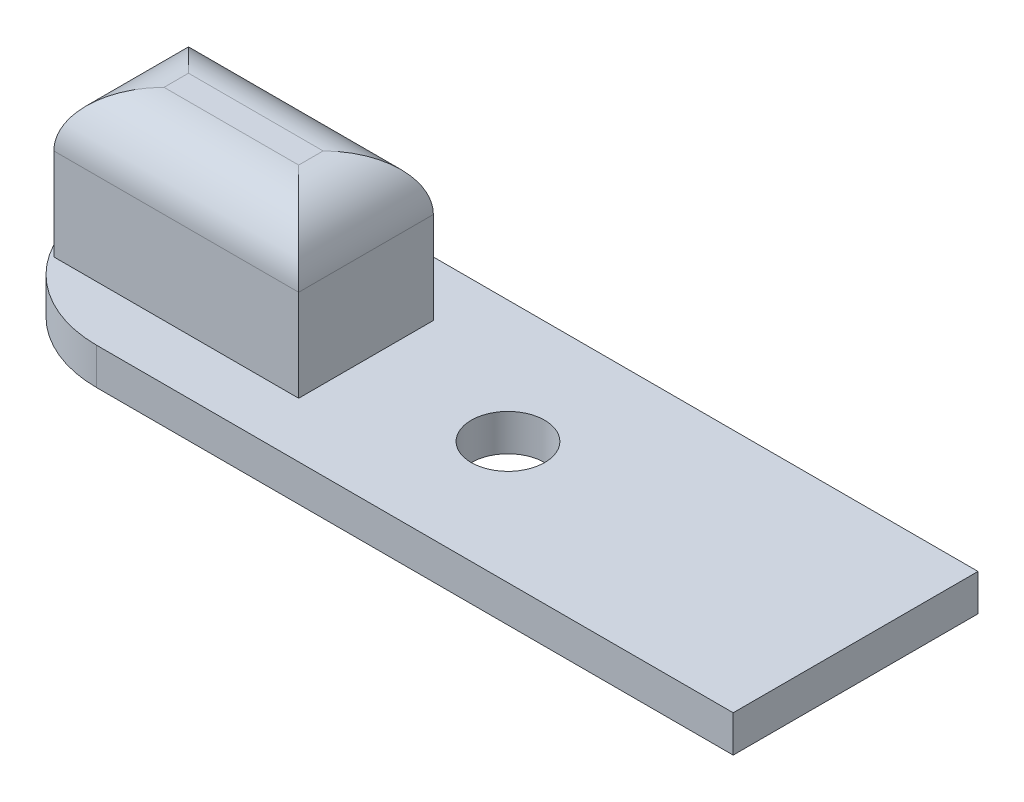
ISO-10303-21;
HEADER;
FILE_DESCRIPTION(('STEP AP214'),'2;1');
FILE_NAME('part.step','',(''),(''),'','','');
FILE_SCHEMA(('AUTOMOTIVE_DESIGN { 1 0 10303 214 1 1 1 1 }'));
ENDSEC;
DATA;
#1=APPLICATION_CONTEXT('core data for automotive mechanical design processes');
#2=APPLICATION_PROTOCOL_DEFINITION('international standard','automotive_design',2000,#1);
#3=PRODUCT_CONTEXT('',#1,'mechanical');
#4=PRODUCT('Part','Part','',(#3));
#5=PRODUCT_RELATED_PRODUCT_CATEGORY('part','',(#4));
#6=PRODUCT_DEFINITION_FORMATION('','',#4);
#7=PRODUCT_DEFINITION_CONTEXT('part definition',#1,'design');
#8=PRODUCT_DEFINITION('design','',#6,#7);
#9=PRODUCT_DEFINITION_SHAPE('','',#8);
#10=(LENGTH_UNIT() NAMED_UNIT(*) SI_UNIT(.MILLI.,.METRE.));
#11=(NAMED_UNIT(*) PLANE_ANGLE_UNIT() SI_UNIT($,.RADIAN.));
#12=(NAMED_UNIT(*) SI_UNIT($,.STERADIAN.) SOLID_ANGLE_UNIT());
#13=UNCERTAINTY_MEASURE_WITH_UNIT(LENGTH_MEASURE(1.E-05),#10,'distance_accuracy_value','');
#14=(GEOMETRIC_REPRESENTATION_CONTEXT(3) GLOBAL_UNCERTAINTY_ASSIGNED_CONTEXT((#13)) GLOBAL_UNIT_ASSIGNED_CONTEXT((#10,
#11,#12)) REPRESENTATION_CONTEXT('',''));
#15=CARTESIAN_POINT('',(0.,0.,0.));
#16=DIRECTION('',(0.,0.,1.));
#17=DIRECTION('',(1.,0.,0.));
#18=AXIS2_PLACEMENT_3D('',#15,#16,#17);
#19=CARTESIAN_POINT('',(0.,1.5,0.));
#20=DIRECTION('',(0.,1.,0.));
#21=DIRECTION('',(0.,0.,1.));
#22=AXIS2_PLACEMENT_3D('',#19,#20,#21);
#23=PLANE('',#22);
#24=CARTESIAN_POINT('',(-14.2,1.5,-5.));
#25=DIRECTION('',(0.,1.,0.));
#26=DIRECTION('',(0.,0.,1.));
#27=AXIS2_PLACEMENT_3D('',#24,#25,#26);
#28=CIRCLE('',#27,1.5);
#29=CARTESIAN_POINT('',(-14.2,1.5,-3.5));
#30=VERTEX_POINT('',#29);
#31=EDGE_CURVE('E136',#30,#30,#28,.T.);
#32=ORIENTED_EDGE('',*,*,#31,.F.);
#33=EDGE_LOOP('',(#32));
#34=FACE_BOUND('',#33,.T.);
#35=CARTESIAN_POINT('',(-26.,1.5,-5.));
#36=DIRECTION('',(0.,1.,0.));
#37=DIRECTION('',(0.,0.,1.));
#38=AXIS2_PLACEMENT_3D('',#35,#36,#37);
#39=CIRCLE('',#38,5.);
#40=CARTESIAN_POINT('',(-26.,1.5,-10.));
#41=VERTEX_POINT('',#40);
#42=CARTESIAN_POINT('',(-31.,1.5,-5.));
#43=VERTEX_POINT('',#42);
#44=EDGE_CURVE('E61',#41,#43,#39,.T.);
#45=ORIENTED_EDGE('',*,*,#44,.T.);
#46=CARTESIAN_POINT('',(-26.,1.5,-5.));
#47=DIRECTION('',(0.,1.,0.));
#48=DIRECTION('',(0.,0.,1.));
#49=AXIS2_PLACEMENT_3D('',#46,#47,#48);
#50=CIRCLE('',#49,5.);
#51=CARTESIAN_POINT('',(-26.,1.5,0.));
#52=VERTEX_POINT('',#51);
#53=EDGE_CURVE('E49',#43,#52,#50,.T.);
#54=ORIENTED_EDGE('',*,*,#53,.T.);
#55=DIRECTION('',(1.,0.,0.));
#56=VECTOR('',#55,1.);
#57=CARTESIAN_POINT('',(-31.,1.5,0.));
#58=LINE('',#57,#56);
#59=CARTESIAN_POINT('',(0.,1.5,0.));
#60=VERTEX_POINT('',#59);
#61=EDGE_CURVE('E175',#52,#60,#58,.T.);
#62=ORIENTED_EDGE('',*,*,#61,.T.);
#63=DIRECTION('',(0.,0.,-1.));
#64=VECTOR('',#63,1.);
#65=CARTESIAN_POINT('',(0.,1.5,-10.));
#66=LINE('',#65,#64);
#67=CARTESIAN_POINT('',(0.,1.5,-10.));
#68=VERTEX_POINT('',#67);
#69=EDGE_CURVE('E178',#60,#68,#66,.T.);
#70=ORIENTED_EDGE('',*,*,#69,.T.);
#71=DIRECTION('',(-1.,0.,0.));
#72=VECTOR('',#71,1.);
#73=CARTESIAN_POINT('',(-31.,1.5,-10.));
#74=LINE('',#73,#72);
#75=EDGE_CURVE('E182',#68,#41,#74,.T.);
#76=ORIENTED_EDGE('',*,*,#75,.T.);
#77=EDGE_LOOP('',(#45,#54,#62,#70,#76));
#78=FACE_BOUND('',#77,.T.);
#79=DIRECTION('',(1.,0.,0.));
#80=VECTOR('',#79,1.);
#81=CARTESIAN_POINT('',(-30.,1.5,-2.25));
#82=LINE('',#81,#80);
#83=CARTESIAN_POINT('',(-30.,1.5,-2.25));
#84=VERTEX_POINT('',#83);
#85=CARTESIAN_POINT('',(-20.,1.5,-2.25));
#86=VERTEX_POINT('',#85);
#87=EDGE_CURVE('E129',#84,#86,#82,.T.);
#88=ORIENTED_EDGE('',*,*,#87,.F.);
#89=DIRECTION('',(0.,0.,1.));
#90=VECTOR('',#89,1.);
#91=CARTESIAN_POINT('',(-30.,1.5,-2.25));
#92=LINE('',#91,#90);
#93=CARTESIAN_POINT('',(-30.,1.5,-7.75));
#94=VERTEX_POINT('',#93);
#95=EDGE_CURVE('E140',#94,#84,#92,.T.);
#96=ORIENTED_EDGE('',*,*,#95,.F.);
#97=DIRECTION('',(-1.,0.,0.));
#98=VECTOR('',#97,1.);
#99=CARTESIAN_POINT('',(-30.,1.5,-7.75));
#100=LINE('',#99,#98);
#101=CARTESIAN_POINT('',(-20.,1.5,-7.75));
#102=VERTEX_POINT('',#101);
#103=EDGE_CURVE('E155',#102,#94,#100,.T.);
#104=ORIENTED_EDGE('',*,*,#103,.F.);
#105=DIRECTION('',(0.,0.,-1.));
#106=VECTOR('',#105,1.);
#107=CARTESIAN_POINT('',(-20.,1.5,-2.25));
#108=LINE('',#107,#106);
#109=EDGE_CURVE('E151',#86,#102,#108,.T.);
#110=ORIENTED_EDGE('',*,*,#109,.F.);
#111=EDGE_LOOP('',(#88,#96,#104,#110));
#112=FACE_BOUND('',#111,.T.);
#113=ADVANCED_FACE('F39',(#34,#78,#112),#23,.T.);
#114=CARTESIAN_POINT('',(-31.,1.5,0.));
#115=DIRECTION('',(0.,0.,-1.));
#116=DIRECTION('',(-1.,0.,0.));
#117=AXIS2_PLACEMENT_3D('',#114,#115,#116);
#118=PLANE('',#117);
#119=ORIENTED_EDGE('',*,*,#61,.F.);
#120=DIRECTION('',(0.,-1.,0.));
#121=VECTOR('',#120,1.);
#122=CARTESIAN_POINT('',(-26.,1.5,0.));
#123=LINE('',#122,#121);
#124=CARTESIAN_POINT('',(-26.,0.,0.));
#125=VERTEX_POINT('',#124);
#126=EDGE_CURVE('E225',#52,#125,#123,.T.);
#127=ORIENTED_EDGE('',*,*,#126,.T.);
#128=DIRECTION('',(1.,0.,0.));
#129=VECTOR('',#128,1.);
#130=CARTESIAN_POINT('',(-31.,0.,0.));
#131=LINE('',#130,#129);
#132=CARTESIAN_POINT('',(0.,0.,0.));
#133=VERTEX_POINT('',#132);
#134=EDGE_CURVE('E174',#125,#133,#131,.T.);
#135=ORIENTED_EDGE('',*,*,#134,.T.);
#136=DIRECTION('',(0.,-1.,0.));
#137=VECTOR('',#136,1.);
#138=CARTESIAN_POINT('',(0.,1.5,0.));
#139=LINE('',#138,#137);
#140=EDGE_CURVE('E196',#60,#133,#139,.T.);
#141=ORIENTED_EDGE('',*,*,#140,.F.);
#142=EDGE_LOOP('',(#119,#127,#135,#141));
#143=FACE_BOUND('',#142,.T.);
#144=ADVANCED_FACE('F258',(#143),#118,.F.);
#145=CARTESIAN_POINT('',(0.,1.5,-10.));
#146=DIRECTION('',(-1.,0.,0.));
#147=DIRECTION('',(0.,0.,1.));
#148=AXIS2_PLACEMENT_3D('',#145,#146,#147);
#149=PLANE('',#148);
#150=DIRECTION('',(0.,0.,-1.));
#151=VECTOR('',#150,1.);
#152=CARTESIAN_POINT('',(0.,0.,-10.));
#153=LINE('',#152,#151);
#154=CARTESIAN_POINT('',(0.,0.,-10.));
#155=VERTEX_POINT('',#154);
#156=EDGE_CURVE('E188',#133,#155,#153,.T.);
#157=ORIENTED_EDGE('',*,*,#156,.T.);
#158=DIRECTION('',(0.,-1.,0.));
#159=VECTOR('',#158,1.);
#160=CARTESIAN_POINT('',(0.,1.5,-10.));
#161=LINE('',#160,#159);
#162=EDGE_CURVE('E185',#68,#155,#161,.T.);
#163=ORIENTED_EDGE('',*,*,#162,.F.);
#164=ORIENTED_EDGE('',*,*,#69,.F.);
#165=ORIENTED_EDGE('',*,*,#140,.T.);
#166=EDGE_LOOP('',(#157,#163,#164,#165));
#167=FACE_BOUND('',#166,.T.);
#168=ADVANCED_FACE('F284',(#167),#149,.F.);
#169=CARTESIAN_POINT('',(-31.,1.5,-10.));
#170=DIRECTION('',(0.,0.,1.));
#171=DIRECTION('',(1.,0.,0.));
#172=AXIS2_PLACEMENT_3D('',#169,#170,#171);
#173=PLANE('',#172);
#174=DIRECTION('',(-1.,0.,0.));
#175=VECTOR('',#174,1.);
#176=CARTESIAN_POINT('',(-31.,0.,-10.));
#177=LINE('',#176,#175);
#178=CARTESIAN_POINT('',(-26.,0.,-10.));
#179=VERTEX_POINT('',#178);
#180=EDGE_CURVE('E179',#155,#179,#177,.T.);
#181=ORIENTED_EDGE('',*,*,#180,.T.);
#182=DIRECTION('',(0.,-1.,0.));
#183=VECTOR('',#182,1.);
#184=CARTESIAN_POINT('',(-26.,1.5,-10.));
#185=LINE('',#184,#183);
#186=EDGE_CURVE('E11',#179,#41,#185,.F.);
#187=ORIENTED_EDGE('',*,*,#186,.T.);
#188=ORIENTED_EDGE('',*,*,#75,.F.);
#189=ORIENTED_EDGE('',*,*,#162,.T.);
#190=EDGE_LOOP('',(#181,#187,#188,#189));
#191=FACE_BOUND('',#190,.T.);
#192=ADVANCED_FACE('F293',(#191),#173,.F.);
#193=CARTESIAN_POINT('',(0.,0.,0.));
#194=DIRECTION('',(0.,1.,0.));
#195=DIRECTION('',(0.,0.,1.));
#196=AXIS2_PLACEMENT_3D('',#193,#194,#195);
#197=PLANE('',#196);
#198=CARTESIAN_POINT('',(-14.2,0.,-5.));
#199=DIRECTION('',(0.,1.,0.));
#200=DIRECTION('',(0.,0.,1.));
#201=AXIS2_PLACEMENT_3D('',#198,#199,#200);
#202=CIRCLE('',#201,1.5);
#203=CARTESIAN_POINT('',(-14.2,0.,-3.5));
#204=VERTEX_POINT('',#203);
#205=EDGE_CURVE('E170',#204,#204,#202,.F.);
#206=ORIENTED_EDGE('',*,*,#205,.F.);
#207=EDGE_LOOP('',(#206));
#208=FACE_BOUND('',#207,.T.);
#209=ORIENTED_EDGE('',*,*,#134,.F.);
#210=CARTESIAN_POINT('',(-26.,0.,-5.));
#211=DIRECTION('',(0.,1.,0.));
#212=DIRECTION('',(0.,0.,1.));
#213=AXIS2_PLACEMENT_3D('',#210,#211,#212);
#214=CIRCLE('',#213,5.);
#215=CARTESIAN_POINT('',(-31.,0.,-5.));
#216=VERTEX_POINT('',#215);
#217=EDGE_CURVE('E245',#125,#216,#214,.F.);
#218=ORIENTED_EDGE('',*,*,#217,.T.);
#219=CARTESIAN_POINT('',(-26.,0.,-5.));
#220=DIRECTION('',(0.,1.,0.));
#221=DIRECTION('',(0.,0.,1.));
#222=AXIS2_PLACEMENT_3D('',#219,#220,#221);
#223=CIRCLE('',#222,5.);
#224=EDGE_CURVE('E242',#216,#179,#223,.F.);
#225=ORIENTED_EDGE('',*,*,#224,.T.);
#226=ORIENTED_EDGE('',*,*,#180,.F.);
#227=ORIENTED_EDGE('',*,*,#156,.F.);
#228=EDGE_LOOP('',(#209,#218,#225,#226,#227));
#229=FACE_BOUND('',#228,.T.);
#230=ADVANCED_FACE('F264',(#208,#229),#197,.F.);
#231=CARTESIAN_POINT('',(-14.2,-0.000999999999999916,-5.));
#232=DIRECTION('',(0.,1.,0.));
#233=DIRECTION('',(0.,0.,1.));
#234=AXIS2_PLACEMENT_3D('',#231,#232,#233);
#235=CYLINDRICAL_SURFACE('',#234,1.5);
#236=ORIENTED_EDGE('',*,*,#31,.T.);
#237=EDGE_LOOP('',(#236));
#238=FACE_BOUND('',#237,.T.);
#239=ORIENTED_EDGE('',*,*,#205,.T.);
#240=EDGE_LOOP('',(#239));
#241=FACE_BOUND('',#240,.T.);
#242=ADVANCED_FACE('F289',(#238,#241),#235,.F.);
#243=CARTESIAN_POINT('',(-30.,7.5,-2.25));
#244=DIRECTION('',(1.,0.,0.));
#245=DIRECTION('',(0.,0.,-1.));
#246=AXIS2_PLACEMENT_3D('',#243,#244,#245);
#247=PLANE('',#246);
#248=DIRECTION('',(0.,-1.,0.));
#249=VECTOR('',#248,1.);
#250=CARTESIAN_POINT('',(-30.,7.5,-2.25));
#251=LINE('',#250,#249);
#252=CARTESIAN_POINT('',(-30.,5.25,-2.25));
#253=VERTEX_POINT('',#252);
#254=EDGE_CURVE('E124',#253,#84,#251,.T.);
#255=ORIENTED_EDGE('',*,*,#254,.F.);
#256=DIRECTION('',(0.,0.,1.));
#257=VECTOR('',#256,1.);
#258=CARTESIAN_POINT('',(-30.,5.25,-2.25));
#259=LINE('',#258,#257);
#260=CARTESIAN_POINT('',(-30.,5.25,-7.75));
#261=VERTEX_POINT('',#260);
#262=EDGE_CURVE('E222',#253,#261,#259,.F.);
#263=ORIENTED_EDGE('',*,*,#262,.T.);
#264=DIRECTION('',(0.,-1.,0.));
#265=VECTOR('',#264,1.);
#266=CARTESIAN_POINT('',(-30.,7.5,-7.75));
#267=LINE('',#266,#265);
#268=EDGE_CURVE('E143',#261,#94,#267,.T.);
#269=ORIENTED_EDGE('',*,*,#268,.T.);
#270=ORIENTED_EDGE('',*,*,#95,.T.);
#271=EDGE_LOOP('',(#255,#263,#269,#270));
#272=FACE_BOUND('',#271,.T.);
#273=ADVANCED_FACE('F141',(#272),#247,.F.);
#274=CARTESIAN_POINT('',(-30.,7.5,-2.25));
#275=DIRECTION('',(0.,0.,-1.));
#276=DIRECTION('',(-1.,0.,0.));
#277=AXIS2_PLACEMENT_3D('',#274,#275,#276);
#278=PLANE('',#277);
#279=DIRECTION('',(0.,-1.,0.));
#280=VECTOR('',#279,1.);
#281=CARTESIAN_POINT('',(-20.,7.5,-2.25));
#282=LINE('',#281,#280);
#283=CARTESIAN_POINT('',(-20.,5.25,-2.25));
#284=VERTEX_POINT('',#283);
#285=EDGE_CURVE('E137',#284,#86,#282,.T.);
#286=ORIENTED_EDGE('',*,*,#285,.F.);
#287=DIRECTION('',(1.,0.,0.));
#288=VECTOR('',#287,1.);
#289=CARTESIAN_POINT('',(-30.,5.25,-2.25));
#290=LINE('',#289,#288);
#291=EDGE_CURVE('E132',#284,#253,#290,.F.);
#292=ORIENTED_EDGE('',*,*,#291,.T.);
#293=ORIENTED_EDGE('',*,*,#254,.T.);
#294=ORIENTED_EDGE('',*,*,#87,.T.);
#295=EDGE_LOOP('',(#286,#292,#293,#294));
#296=FACE_BOUND('',#295,.T.);
#297=ADVANCED_FACE('F127',(#296),#278,.F.);
#298=CARTESIAN_POINT('',(-20.,7.5,-2.25));
#299=DIRECTION('',(-1.,0.,0.));
#300=DIRECTION('',(0.,0.,1.));
#301=AXIS2_PLACEMENT_3D('',#298,#299,#300);
#302=PLANE('',#301);
#303=DIRECTION('',(0.,-1.,0.));
#304=VECTOR('',#303,1.);
#305=CARTESIAN_POINT('',(-20.,7.5,-7.75));
#306=LINE('',#305,#304);
#307=CARTESIAN_POINT('',(-20.,5.25,-7.75));
#308=VERTEX_POINT('',#307);
#309=EDGE_CURVE('E162',#308,#102,#306,.T.);
#310=ORIENTED_EDGE('',*,*,#309,.F.);
#311=DIRECTION('',(0.,0.,-1.));
#312=VECTOR('',#311,1.);
#313=CARTESIAN_POINT('',(-20.,5.25,-2.25));
#314=LINE('',#313,#312);
#315=EDGE_CURVE('E217',#308,#284,#314,.F.);
#316=ORIENTED_EDGE('',*,*,#315,.T.);
#317=ORIENTED_EDGE('',*,*,#285,.T.);
#318=ORIENTED_EDGE('',*,*,#109,.T.);
#319=EDGE_LOOP('',(#310,#316,#317,#318));
#320=FACE_BOUND('',#319,.T.);
#321=ADVANCED_FACE('F330',(#320),#302,.F.);
#322=CARTESIAN_POINT('',(-30.,7.5,-7.75));
#323=DIRECTION('',(0.,0.,1.));
#324=DIRECTION('',(1.,0.,0.));
#325=AXIS2_PLACEMENT_3D('',#322,#323,#324);
#326=PLANE('',#325);
#327=ORIENTED_EDGE('',*,*,#268,.F.);
#328=DIRECTION('',(-1.,0.,0.));
#329=VECTOR('',#328,1.);
#330=CARTESIAN_POINT('',(-30.,5.25,-7.75));
#331=LINE('',#330,#329);
#332=EDGE_CURVE('E213',#261,#308,#331,.F.);
#333=ORIENTED_EDGE('',*,*,#332,.T.);
#334=ORIENTED_EDGE('',*,*,#309,.T.);
#335=ORIENTED_EDGE('',*,*,#103,.T.);
#336=EDGE_LOOP('',(#327,#333,#334,#335));
#337=FACE_BOUND('',#336,.T.);
#338=ADVANCED_FACE('F314',(#337),#326,.F.);
#339=CARTESIAN_POINT('',(0.,7.5,0.));
#340=DIRECTION('',(0.,-1.,0.));
#341=DIRECTION('',(0.,0.,-1.));
#342=AXIS2_PLACEMENT_3D('',#339,#340,#341);
#343=PLANE('',#342);
#344=DIRECTION('',(0.,0.,-1.));
#345=VECTOR('',#344,1.);
#346=CARTESIAN_POINT('',(-22.25,7.5,0.));
#347=LINE('',#346,#345);
#348=CARTESIAN_POINT('',(-22.25,7.5,-4.5));
#349=VERTEX_POINT('',#348);
#350=CARTESIAN_POINT('',(-22.25,7.5,-5.5));
#351=VERTEX_POINT('',#350);
#352=EDGE_CURVE('E206',#349,#351,#347,.T.);
#353=ORIENTED_EDGE('',*,*,#352,.T.);
#354=DIRECTION('',(-1.,0.,0.));
#355=VECTOR('',#354,1.);
#356=CARTESIAN_POINT('',(0.,7.5,-5.5));
#357=LINE('',#356,#355);
#358=CARTESIAN_POINT('',(-27.75,7.5,-5.5));
#359=VERTEX_POINT('',#358);
#360=EDGE_CURVE('E209',#351,#359,#357,.T.);
#361=ORIENTED_EDGE('',*,*,#360,.T.);
#362=DIRECTION('',(0.,0.,1.));
#363=VECTOR('',#362,1.);
#364=CARTESIAN_POINT('',(-27.75,7.5,0.));
#365=LINE('',#364,#363);
#366=CARTESIAN_POINT('',(-27.75,7.5,-4.5));
#367=VERTEX_POINT('',#366);
#368=EDGE_CURVE('E200',#359,#367,#365,.T.);
#369=ORIENTED_EDGE('',*,*,#368,.T.);
#370=DIRECTION('',(1.,0.,0.));
#371=VECTOR('',#370,1.);
#372=CARTESIAN_POINT('',(0.,7.5,-4.5));
#373=LINE('',#372,#371);
#374=EDGE_CURVE('E203',#367,#349,#373,.T.);
#375=ORIENTED_EDGE('',*,*,#374,.T.);
#376=EDGE_LOOP('',(#353,#361,#369,#375));
#377=FACE_BOUND('',#376,.T.);
#378=ADVANCED_FACE('F309',(#377),#343,.F.);
#379=CARTESIAN_POINT('',(0.,5.25,-4.5));
#380=DIRECTION('',(1.,0.,0.));
#381=DIRECTION('',(0.,0.,-1.));
#382=AXIS2_PLACEMENT_3D('',#379,#380,#381);
#383=CYLINDRICAL_SURFACE('',#382,2.25);
#384=CARTESIAN_POINT('',(-27.75,5.25,-4.5));
#385=DIRECTION('',(0.707106781186547,0.,0.707106781186548));
#386=DIRECTION('',(-0.707106781186548,0.,0.707106781186547));
#387=AXIS2_PLACEMENT_3D('',#384,#385,#386);
#388=ELLIPSE('',#387,3.18198051533946,2.25);
#389=EDGE_CURVE('E232',#253,#367,#388,.F.);
#390=ORIENTED_EDGE('',*,*,#389,.F.);
#391=ORIENTED_EDGE('',*,*,#291,.F.);
#392=CARTESIAN_POINT('',(-22.25,5.25,-4.5));
#393=DIRECTION('',(0.707106781186547,0.,-0.707106781186547));
#394=DIRECTION('',(0.707106781186547,0.,0.707106781186547));
#395=AXIS2_PLACEMENT_3D('',#392,#393,#394);
#396=ELLIPSE('',#395,3.18198051533946,2.25);
#397=EDGE_CURVE('E148',#349,#284,#396,.T.);
#398=ORIENTED_EDGE('',*,*,#397,.F.);
#399=ORIENTED_EDGE('',*,*,#374,.F.);
#400=EDGE_LOOP('',(#390,#391,#398,#399));
#401=FACE_BOUND('',#400,.T.);
#402=ADVANCED_FACE('F306',(#401),#383,.T.);
#403=CARTESIAN_POINT('',(-22.25,5.25,0.));
#404=DIRECTION('',(0.,0.,-1.));
#405=DIRECTION('',(-1.,0.,0.));
#406=AXIS2_PLACEMENT_3D('',#403,#404,#405);
#407=CYLINDRICAL_SURFACE('',#406,2.25);
#408=ORIENTED_EDGE('',*,*,#397,.T.);
#409=ORIENTED_EDGE('',*,*,#315,.F.);
#410=CARTESIAN_POINT('',(-22.25,5.25,-5.5));
#411=DIRECTION('',(-0.707106781186547,0.,-0.707106781186547));
#412=DIRECTION('',(0.707106781186547,0.,-0.707106781186547));
#413=AXIS2_PLACEMENT_3D('',#410,#411,#412);
#414=ELLIPSE('',#413,3.18198051533946,2.25);
#415=EDGE_CURVE('E229',#351,#308,#414,.T.);
#416=ORIENTED_EDGE('',*,*,#415,.F.);
#417=ORIENTED_EDGE('',*,*,#352,.F.);
#418=EDGE_LOOP('',(#408,#409,#416,#417));
#419=FACE_BOUND('',#418,.T.);
#420=ADVANCED_FACE('F302',(#419),#407,.T.);
#421=CARTESIAN_POINT('',(-27.75,5.25,0.));
#422=DIRECTION('',(0.,0.,1.));
#423=DIRECTION('',(1.,0.,0.));
#424=AXIS2_PLACEMENT_3D('',#421,#422,#423);
#425=CYLINDRICAL_SURFACE('',#424,2.25);
#426=ORIENTED_EDGE('',*,*,#389,.T.);
#427=ORIENTED_EDGE('',*,*,#368,.F.);
#428=CARTESIAN_POINT('',(-27.75,5.25,-5.5));
#429=DIRECTION('',(-0.707106781186548,0.,0.707106781186547));
#430=DIRECTION('',(0.707106781186547,0.,0.707106781186548));
#431=AXIS2_PLACEMENT_3D('',#428,#429,#430);
#432=ELLIPSE('',#431,3.18198051533946,2.25);
#433=EDGE_CURVE('E226',#261,#359,#432,.F.);
#434=ORIENTED_EDGE('',*,*,#433,.F.);
#435=ORIENTED_EDGE('',*,*,#262,.F.);
#436=EDGE_LOOP('',(#426,#427,#434,#435));
#437=FACE_BOUND('',#436,.T.);
#438=ADVANCED_FACE('F275',(#437),#425,.T.);
#439=CARTESIAN_POINT('',(0.,5.25,-5.5));
#440=DIRECTION('',(-1.,0.,0.));
#441=DIRECTION('',(0.,0.,1.));
#442=AXIS2_PLACEMENT_3D('',#439,#440,#441);
#443=CYLINDRICAL_SURFACE('',#442,2.25);
#444=ORIENTED_EDGE('',*,*,#415,.T.);
#445=ORIENTED_EDGE('',*,*,#332,.F.);
#446=ORIENTED_EDGE('',*,*,#433,.T.);
#447=ORIENTED_EDGE('',*,*,#360,.F.);
#448=EDGE_LOOP('',(#444,#445,#446,#447));
#449=FACE_BOUND('',#448,.T.);
#450=ADVANCED_FACE('F270',(#449),#443,.T.);
#451=CARTESIAN_POINT('',(-26.,1.5,-5.));
#452=DIRECTION('',(0.,-1.,0.));
#453=DIRECTION('',(0.,0.,-1.));
#454=AXIS2_PLACEMENT_3D('',#451,#452,#453);
#455=CYLINDRICAL_SURFACE('',#454,5.);
#456=DIRECTION('',(0.,-1.,0.));
#457=VECTOR('',#456,1.);
#458=CARTESIAN_POINT('',(-31.,1.5,-5.));
#459=LINE('',#458,#457);
#460=EDGE_CURVE('E43',#43,#216,#459,.T.);
#461=ORIENTED_EDGE('',*,*,#460,.F.);
#462=ORIENTED_EDGE('',*,*,#44,.F.);
#463=ORIENTED_EDGE('',*,*,#186,.F.);
#464=ORIENTED_EDGE('',*,*,#224,.F.);
#465=EDGE_LOOP('',(#461,#462,#463,#464));
#466=FACE_BOUND('',#465,.T.);
#467=ADVANCED_FACE('F41',(#466),#455,.T.);
#468=CARTESIAN_POINT('',(-26.,1.5,-5.));
#469=DIRECTION('',(0.,-1.,0.));
#470=DIRECTION('',(0.,0.,-1.));
#471=AXIS2_PLACEMENT_3D('',#468,#469,#470);
#472=CYLINDRICAL_SURFACE('',#471,5.);
#473=ORIENTED_EDGE('',*,*,#53,.F.);
#474=ORIENTED_EDGE('',*,*,#460,.T.);
#475=ORIENTED_EDGE('',*,*,#217,.F.);
#476=ORIENTED_EDGE('',*,*,#126,.F.);
#477=EDGE_LOOP('',(#473,#474,#475,#476));
#478=FACE_BOUND('',#477,.T.);
#479=ADVANCED_FACE('F261',(#478),#472,.T.);
#480=CLOSED_SHELL('',(#113,#144,#168,#192,#230,#242,#273,#297,#321,#338,#378,#402,#420,#438,
#450,#467,#479));
#481=MANIFOLD_SOLID_BREP('B2',#480);
#482=ADVANCED_BREP_SHAPE_REPRESENTATION('',(#18,#481),#14);
#483=SHAPE_DEFINITION_REPRESENTATION(#9,#482);
ENDSEC;
END-ISO-10303-21;
